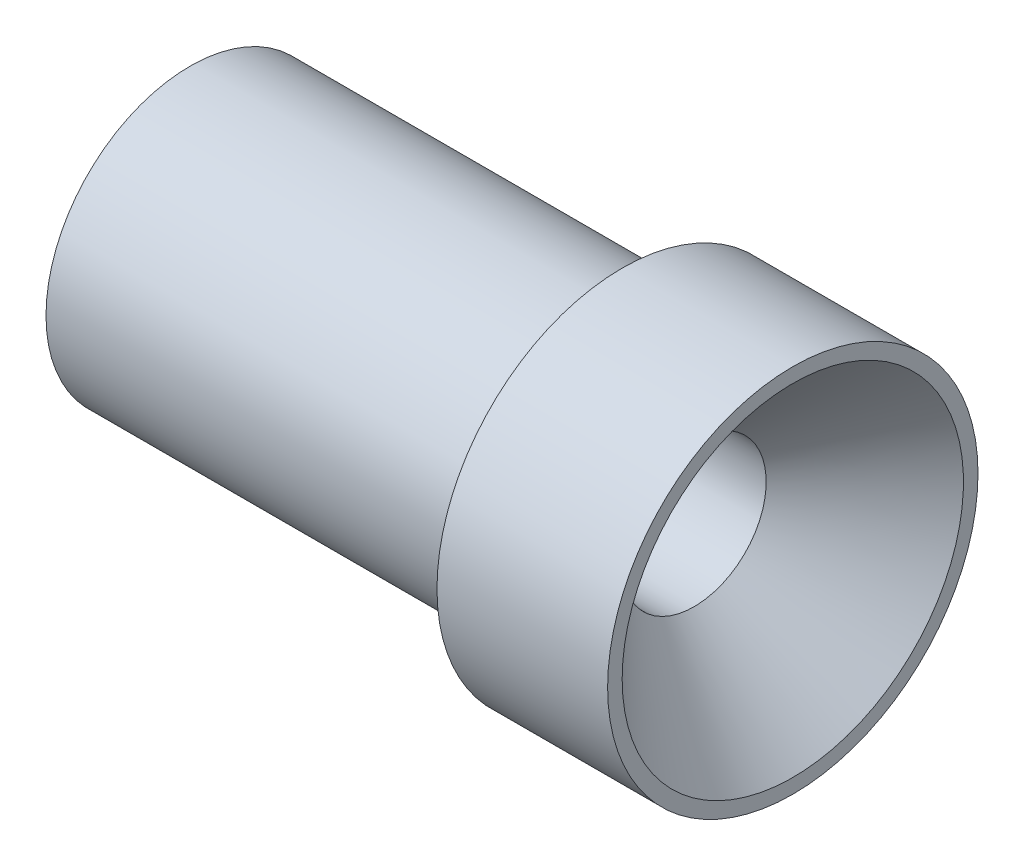
ISO-10303-21;
HEADER;
FILE_DESCRIPTION(('STEP AP214'),'2;1');
FILE_NAME('part.step','',(''),(''),'','','');
FILE_SCHEMA(('AUTOMOTIVE_DESIGN { 1 0 10303 214 1 1 1 1 }'));
ENDSEC;
DATA;
#1=APPLICATION_CONTEXT('core data for automotive mechanical design processes');
#2=APPLICATION_PROTOCOL_DEFINITION('international standard','automotive_design',2000,#1);
#3=PRODUCT_CONTEXT('',#1,'mechanical');
#4=PRODUCT('Part','Part','',(#3));
#5=PRODUCT_RELATED_PRODUCT_CATEGORY('part','',(#4));
#6=PRODUCT_DEFINITION_FORMATION('','',#4);
#7=PRODUCT_DEFINITION_CONTEXT('part definition',#1,'design');
#8=PRODUCT_DEFINITION('design','',#6,#7);
#9=PRODUCT_DEFINITION_SHAPE('','',#8);
#10=(LENGTH_UNIT() NAMED_UNIT(*) SI_UNIT(.MILLI.,.METRE.));
#11=(NAMED_UNIT(*) PLANE_ANGLE_UNIT() SI_UNIT($,.RADIAN.));
#12=(NAMED_UNIT(*) SI_UNIT($,.STERADIAN.) SOLID_ANGLE_UNIT());
#13=UNCERTAINTY_MEASURE_WITH_UNIT(LENGTH_MEASURE(1.E-05),#10,'distance_accuracy_value','');
#14=(GEOMETRIC_REPRESENTATION_CONTEXT(3) GLOBAL_UNCERTAINTY_ASSIGNED_CONTEXT((#13)) GLOBAL_UNIT_ASSIGNED_CONTEXT((#10,
#11,#12)) REPRESENTATION_CONTEXT('',''));
#15=CARTESIAN_POINT('',(0.,0.,0.));
#16=DIRECTION('',(0.,0.,1.));
#17=DIRECTION('',(1.,0.,0.));
#18=AXIS2_PLACEMENT_3D('',#15,#16,#17);
#19=CARTESIAN_POINT('',(12.25,0.,0.));
#20=DIRECTION('',(1.,0.,0.));
#21=DIRECTION('',(0.,0.,-1.));
#22=AXIS2_PLACEMENT_3D('',#19,#20,#21);
#23=CONICAL_SURFACE('',#22,1.75,0.78539816339745);
#24=CARTESIAN_POINT('',(14.6464466094067,0.,0.));
#25=DIRECTION('',(-1.,0.,0.));
#26=DIRECTION('',(0.,0.,1.));
#27=AXIS2_PLACEMENT_3D('',#24,#25,#26);
#28=CIRCLE('',#27,4.14644660940672);
#29=CARTESIAN_POINT('',(14.6464466094067,0.,4.14644660940672));
#30=VERTEX_POINT('',#29);
#31=EDGE_CURVE('E10',#30,#30,#28,.F.);
#32=ORIENTED_EDGE('',*,*,#31,.T.);
#33=EDGE_LOOP('',(#32));
#34=FACE_BOUND('',#33,.T.);
#35=CARTESIAN_POINT('',(12.25,0.,0.));
#36=DIRECTION('',(-1.,0.,0.));
#37=DIRECTION('',(0.,0.,1.));
#38=AXIS2_PLACEMENT_3D('',#35,#36,#37);
#39=CIRCLE('',#38,1.75);
#40=CARTESIAN_POINT('',(12.25,0.,1.75));
#41=VERTEX_POINT('',#40);
#42=EDGE_CURVE('E59',#41,#41,#39,.T.);
#43=ORIENTED_EDGE('',*,*,#42,.T.);
#44=EDGE_LOOP('',(#43));
#45=FACE_BOUND('',#44,.T.);
#46=ADVANCED_FACE('F43',(#34,#45),#23,.F.);
#47=CARTESIAN_POINT('',(0.,0.,0.));
#48=DIRECTION('',(-1.,0.,0.));
#49=DIRECTION('',(0.,0.,1.));
#50=AXIS2_PLACEMENT_3D('',#47,#48,#49);
#51=CYLINDRICAL_SURFACE('',#50,1.75);
#52=ORIENTED_EDGE('',*,*,#42,.F.);
#53=EDGE_LOOP('',(#52));
#54=FACE_BOUND('',#53,.T.);
#55=CARTESIAN_POINT('',(0.,0.,0.));
#56=DIRECTION('',(-1.,0.,0.));
#57=DIRECTION('',(0.,0.,1.));
#58=AXIS2_PLACEMENT_3D('',#55,#56,#57);
#59=CIRCLE('',#58,1.75);
#60=CARTESIAN_POINT('',(0.,0.,1.75));
#61=VERTEX_POINT('',#60);
#62=EDGE_CURVE('E66',#61,#61,#59,.T.);
#63=ORIENTED_EDGE('',*,*,#62,.T.);
#64=EDGE_LOOP('',(#63));
#65=FACE_BOUND('',#64,.T.);
#66=ADVANCED_FACE('F101',(#54,#65),#51,.F.);
#67=CARTESIAN_POINT('',(0.,1.75,0.));
#68=DIRECTION('',(1.,0.,0.));
#69=DIRECTION('',(0.,0.,-1.));
#70=AXIS2_PLACEMENT_3D('',#67,#68,#69);
#71=PLANE('',#70);
#72=ORIENTED_EDGE('',*,*,#62,.F.);
#73=EDGE_LOOP('',(#72));
#74=FACE_BOUND('',#73,.T.);
#75=CARTESIAN_POINT('',(0.,0.,0.));
#76=DIRECTION('',(-1.,0.,0.));
#77=DIRECTION('',(0.,0.,1.));
#78=AXIS2_PLACEMENT_3D('',#75,#76,#77);
#79=CIRCLE('',#78,3.5);
#80=CARTESIAN_POINT('',(0.,0.,3.5));
#81=VERTEX_POINT('',#80);
#82=EDGE_CURVE('E72',#81,#81,#79,.T.);
#83=ORIENTED_EDGE('',*,*,#82,.T.);
#84=EDGE_LOOP('',(#83));
#85=FACE_BOUND('',#84,.T.);
#86=ADVANCED_FACE('F105',(#74,#85),#71,.F.);
#87=CARTESIAN_POINT('',(0.,0.,0.));
#88=DIRECTION('',(-1.,0.,0.));
#89=DIRECTION('',(0.,0.,1.));
#90=AXIS2_PLACEMENT_3D('',#87,#88,#89);
#91=CYLINDRICAL_SURFACE('',#90,3.5);
#92=ORIENTED_EDGE('',*,*,#82,.F.);
#93=EDGE_LOOP('',(#92));
#94=FACE_BOUND('',#93,.T.);
#95=CARTESIAN_POINT('',(10.5,0.,0.));
#96=DIRECTION('',(-1.,0.,0.));
#97=DIRECTION('',(0.,0.,1.));
#98=AXIS2_PLACEMENT_3D('',#95,#96,#97);
#99=CIRCLE('',#98,3.5);
#100=CARTESIAN_POINT('',(10.5,0.,3.5));
#101=VERTEX_POINT('',#100);
#102=EDGE_CURVE('E76',#101,#101,#99,.T.);
#103=ORIENTED_EDGE('',*,*,#102,.T.);
#104=EDGE_LOOP('',(#103));
#105=FACE_BOUND('',#104,.T.);
#106=ADVANCED_FACE('F97',(#94,#105),#91,.T.);
#107=CARTESIAN_POINT('',(10.5,3.5,0.));
#108=DIRECTION('',(1.,0.,0.));
#109=DIRECTION('',(0.,0.,-1.));
#110=AXIS2_PLACEMENT_3D('',#107,#108,#109);
#111=PLANE('',#110);
#112=ORIENTED_EDGE('',*,*,#102,.F.);
#113=EDGE_LOOP('',(#112));
#114=FACE_BOUND('',#113,.T.);
#115=CARTESIAN_POINT('',(10.5,0.,0.));
#116=DIRECTION('',(-1.,0.,0.));
#117=DIRECTION('',(0.,0.,1.));
#118=AXIS2_PLACEMENT_3D('',#115,#116,#117);
#119=CIRCLE('',#118,4.5);
#120=CARTESIAN_POINT('',(10.5,0.,4.5));
#121=VERTEX_POINT('',#120);
#122=EDGE_CURVE('E80',#121,#121,#119,.T.);
#123=ORIENTED_EDGE('',*,*,#122,.T.);
#124=EDGE_LOOP('',(#123));
#125=FACE_BOUND('',#124,.T.);
#126=ADVANCED_FACE('F87',(#114,#125),#111,.F.);
#127=CARTESIAN_POINT('',(0.,0.,0.));
#128=DIRECTION('',(-1.,0.,0.));
#129=DIRECTION('',(0.,0.,1.));
#130=AXIS2_PLACEMENT_3D('',#127,#128,#129);
#131=CYLINDRICAL_SURFACE('',#130,4.5);
#132=CARTESIAN_POINT('',(14.6464466094067,0.,0.));
#133=DIRECTION('',(-1.,0.,0.));
#134=DIRECTION('',(0.,0.,1.));
#135=AXIS2_PLACEMENT_3D('',#132,#133,#134);
#136=CIRCLE('',#135,4.5);
#137=CARTESIAN_POINT('',(14.6464466094067,0.,4.5));
#138=VERTEX_POINT('',#137);
#139=EDGE_CURVE('E52',#138,#138,#136,.T.);
#140=ORIENTED_EDGE('',*,*,#139,.T.);
#141=EDGE_LOOP('',(#140));
#142=FACE_BOUND('',#141,.T.);
#143=ORIENTED_EDGE('',*,*,#122,.F.);
#144=EDGE_LOOP('',(#143));
#145=FACE_BOUND('',#144,.T.);
#146=ADVANCED_FACE('F89',(#142,#145),#131,.T.);
#147=CARTESIAN_POINT('',(14.6464466094067,0.,0.));
#148=DIRECTION('',(1.,0.,0.));
#149=DIRECTION('',(0.,0.,-1.));
#150=AXIS2_PLACEMENT_3D('',#147,#148,#149);
#151=PLANE('',#150);
#152=ORIENTED_EDGE('',*,*,#31,.F.);
#153=EDGE_LOOP('',(#152));
#154=FACE_BOUND('',#153,.T.);
#155=ORIENTED_EDGE('',*,*,#139,.F.);
#156=EDGE_LOOP('',(#155));
#157=FACE_BOUND('',#156,.T.);
#158=ADVANCED_FACE('F46',(#154,#157),#151,.T.);
#159=CLOSED_SHELL('',(#46,#66,#86,#106,#126,#146,#158));
#160=MANIFOLD_SOLID_BREP('B2',#159);
#161=ADVANCED_BREP_SHAPE_REPRESENTATION('',(#18,#160),#14);
#162=SHAPE_DEFINITION_REPRESENTATION(#9,#161);
ENDSEC;
END-ISO-10303-21;
